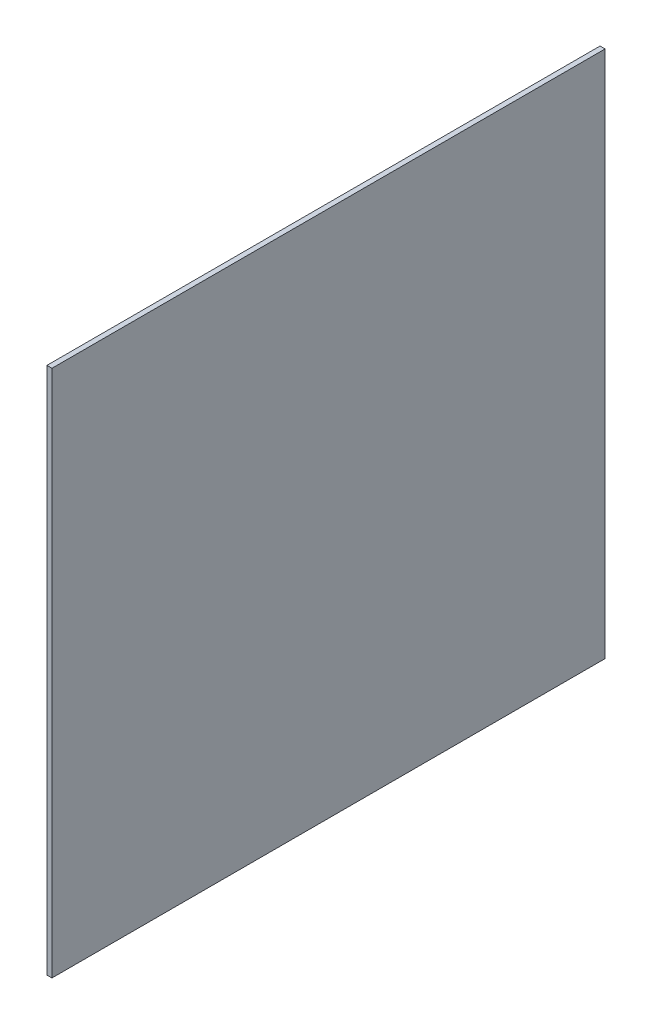
ISO-10303-21;
HEADER;
FILE_DESCRIPTION(('STEP AP214'),'2;1');
FILE_NAME('part.step','',(''),(''),'','','');
FILE_SCHEMA(('AUTOMOTIVE_DESIGN { 1 0 10303 214 1 1 1 1 }'));
ENDSEC;
DATA;
#1=APPLICATION_CONTEXT('core data for automotive mechanical design processes');
#2=APPLICATION_PROTOCOL_DEFINITION('international standard','automotive_design',2000,#1);
#3=PRODUCT_CONTEXT('',#1,'mechanical');
#4=PRODUCT('Part','Part','',(#3));
#5=PRODUCT_RELATED_PRODUCT_CATEGORY('part','',(#4));
#6=PRODUCT_DEFINITION_FORMATION('','',#4);
#7=PRODUCT_DEFINITION_CONTEXT('part definition',#1,'design');
#8=PRODUCT_DEFINITION('design','',#6,#7);
#9=PRODUCT_DEFINITION_SHAPE('','',#8);
#10=(LENGTH_UNIT() NAMED_UNIT(*) SI_UNIT(.MILLI.,.METRE.));
#11=(NAMED_UNIT(*) PLANE_ANGLE_UNIT() SI_UNIT($,.RADIAN.));
#12=(NAMED_UNIT(*) SI_UNIT($,.STERADIAN.) SOLID_ANGLE_UNIT());
#13=UNCERTAINTY_MEASURE_WITH_UNIT(LENGTH_MEASURE(1.E-05),#10,'distance_accuracy_value','');
#14=(GEOMETRIC_REPRESENTATION_CONTEXT(3) GLOBAL_UNCERTAINTY_ASSIGNED_CONTEXT((#13)) GLOBAL_UNIT_ASSIGNED_CONTEXT((#10,
#11,#12)) REPRESENTATION_CONTEXT('',''));
#15=CARTESIAN_POINT('',(0.,0.,0.));
#16=DIRECTION('',(0.,0.,1.));
#17=DIRECTION('',(1.,0.,0.));
#18=AXIS2_PLACEMENT_3D('',#15,#16,#17);
#19=CARTESIAN_POINT('',(-283.,239.840100222647,-224.));
#20=DIRECTION('',(0.,0.,-1.));
#21=DIRECTION('',(0.,1.,0.));
#22=AXIS2_PLACEMENT_3D('',#19,#20,#21);
#23=PLANE('',#22);
#24=DIRECTION('',(0.,-1.,0.));
#25=VECTOR('',#24,1.);
#26=CARTESIAN_POINT('',(-285.,239.840100222647,-224.));
#27=LINE('',#26,#25);
#28=CARTESIAN_POINT('',(-285.,239.840100222647,-224.));
#29=VERTEX_POINT('',#28);
#30=CARTESIAN_POINT('',(-285.,29.8401002226472,-224.));
#31=VERTEX_POINT('',#30);
#32=EDGE_CURVE('E112',#29,#31,#27,.T.);
#33=ORIENTED_EDGE('',*,*,#32,.F.);
#34=DIRECTION('',(-1.,0.,0.));
#35=VECTOR('',#34,1.);
#36=CARTESIAN_POINT('',(-283.,239.840100222647,-224.));
#37=LINE('',#36,#35);
#38=CARTESIAN_POINT('',(-283.,239.840100222647,-224.));
#39=VERTEX_POINT('',#38);
#40=EDGE_CURVE('E11',#39,#29,#37,.T.);
#41=ORIENTED_EDGE('',*,*,#40,.F.);
#42=DIRECTION('',(0.,-1.,0.));
#43=VECTOR('',#42,1.);
#44=CARTESIAN_POINT('',(-283.,239.840100222647,-224.));
#45=LINE('',#44,#43);
#46=CARTESIAN_POINT('',(-283.,29.8401002226472,-224.));
#47=VERTEX_POINT('',#46);
#48=EDGE_CURVE('E103',#39,#47,#45,.T.);
#49=ORIENTED_EDGE('',*,*,#48,.T.);
#50=DIRECTION('',(-1.,0.,0.));
#51=VECTOR('',#50,1.);
#52=CARTESIAN_POINT('',(-283.,29.8401002226472,-224.));
#53=LINE('',#52,#51);
#54=EDGE_CURVE('E44',#47,#31,#53,.T.);
#55=ORIENTED_EDGE('',*,*,#54,.T.);
#56=EDGE_LOOP('',(#33,#41,#49,#55));
#57=FACE_BOUND('',#56,.T.);
#58=ADVANCED_FACE('F41',(#57),#23,.T.);
#59=CARTESIAN_POINT('',(-283.,239.840100222647,-224.));
#60=DIRECTION('',(0.,1.,0.));
#61=DIRECTION('',(0.,0.,1.));
#62=AXIS2_PLACEMENT_3D('',#59,#60,#61);
#63=PLANE('',#62);
#64=DIRECTION('',(0.,0.,-1.));
#65=VECTOR('',#64,1.);
#66=CARTESIAN_POINT('',(-285.,239.840100222647,-224.));
#67=LINE('',#66,#65);
#68=CARTESIAN_POINT('',(-285.,239.840100222647,-4.00000000000003));
#69=VERTEX_POINT('',#68);
#70=EDGE_CURVE('E107',#69,#29,#67,.T.);
#71=ORIENTED_EDGE('',*,*,#70,.F.);
#72=DIRECTION('',(-1.,0.,0.));
#73=VECTOR('',#72,1.);
#74=CARTESIAN_POINT('',(-283.,239.840100222647,-4.00000000000003));
#75=LINE('',#74,#73);
#76=CARTESIAN_POINT('',(-283.,239.840100222647,-4.00000000000003));
#77=VERTEX_POINT('',#76);
#78=EDGE_CURVE('E51',#77,#69,#75,.T.);
#79=ORIENTED_EDGE('',*,*,#78,.F.);
#80=DIRECTION('',(0.,0.,-1.));
#81=VECTOR('',#80,1.);
#82=CARTESIAN_POINT('',(-283.,239.840100222647,-224.));
#83=LINE('',#82,#81);
#84=EDGE_CURVE('E98',#77,#39,#83,.T.);
#85=ORIENTED_EDGE('',*,*,#84,.T.);
#86=ORIENTED_EDGE('',*,*,#40,.T.);
#87=EDGE_LOOP('',(#71,#79,#85,#86));
#88=FACE_BOUND('',#87,.T.);
#89=ADVANCED_FACE('F131',(#88),#63,.T.);
#90=CARTESIAN_POINT('',(-283.,239.840100222647,-4.00000000000003));
#91=DIRECTION('',(0.,0.,1.));
#92=DIRECTION('',(0.,-1.,0.));
#93=AXIS2_PLACEMENT_3D('',#90,#91,#92);
#94=PLANE('',#93);
#95=DIRECTION('',(0.,1.,0.));
#96=VECTOR('',#95,1.);
#97=CARTESIAN_POINT('',(-285.,239.840100222647,-4.00000000000003));
#98=LINE('',#97,#96);
#99=CARTESIAN_POINT('',(-285.,29.8401002226472,-4.));
#100=VERTEX_POINT('',#99);
#101=EDGE_CURVE('E92',#100,#69,#98,.T.);
#102=ORIENTED_EDGE('',*,*,#101,.F.);
#103=DIRECTION('',(-1.,0.,0.));
#104=VECTOR('',#103,1.);
#105=CARTESIAN_POINT('',(-283.,29.8401002226472,-4.));
#106=LINE('',#105,#104);
#107=CARTESIAN_POINT('',(-283.,29.8401002226472,-4.));
#108=VERTEX_POINT('',#107);
#109=EDGE_CURVE('E87',#108,#100,#106,.T.);
#110=ORIENTED_EDGE('',*,*,#109,.F.);
#111=DIRECTION('',(0.,1.,0.));
#112=VECTOR('',#111,1.);
#113=CARTESIAN_POINT('',(-283.,239.840100222647,-4.00000000000003));
#114=LINE('',#113,#112);
#115=EDGE_CURVE('E90',#108,#77,#114,.T.);
#116=ORIENTED_EDGE('',*,*,#115,.T.);
#117=ORIENTED_EDGE('',*,*,#78,.T.);
#118=EDGE_LOOP('',(#102,#110,#116,#117));
#119=FACE_BOUND('',#118,.T.);
#120=ADVANCED_FACE('F89',(#119),#94,.T.);
#121=CARTESIAN_POINT('',(-283.,29.8401002226472,-224.));
#122=DIRECTION('',(0.,-1.,0.));
#123=DIRECTION('',(0.,0.,-1.));
#124=AXIS2_PLACEMENT_3D('',#121,#122,#123);
#125=PLANE('',#124);
#126=DIRECTION('',(0.,0.,1.));
#127=VECTOR('',#126,1.);
#128=CARTESIAN_POINT('',(-285.,29.8401002226472,-224.));
#129=LINE('',#128,#127);
#130=EDGE_CURVE('E116',#31,#100,#129,.T.);
#131=ORIENTED_EDGE('',*,*,#130,.F.);
#132=ORIENTED_EDGE('',*,*,#54,.F.);
#133=DIRECTION('',(0.,0.,1.));
#134=VECTOR('',#133,1.);
#135=CARTESIAN_POINT('',(-283.,29.8401002226472,-224.));
#136=LINE('',#135,#134);
#137=EDGE_CURVE('E97',#47,#108,#136,.T.);
#138=ORIENTED_EDGE('',*,*,#137,.T.);
#139=ORIENTED_EDGE('',*,*,#109,.T.);
#140=EDGE_LOOP('',(#131,#132,#138,#139));
#141=FACE_BOUND('',#140,.T.);
#142=ADVANCED_FACE('F101',(#141),#125,.T.);
#143=CARTESIAN_POINT('',(-283.,0.,0.));
#144=DIRECTION('',(-1.,0.,0.));
#145=DIRECTION('',(0.,0.,1.));
#146=AXIS2_PLACEMENT_3D('',#143,#144,#145);
#147=PLANE('',#146);
#148=ORIENTED_EDGE('',*,*,#48,.F.);
#149=ORIENTED_EDGE('',*,*,#84,.F.);
#150=ORIENTED_EDGE('',*,*,#115,.F.);
#151=ORIENTED_EDGE('',*,*,#137,.F.);
#152=EDGE_LOOP('',(#148,#149,#150,#151));
#153=FACE_BOUND('',#152,.T.);
#154=ADVANCED_FACE('F96',(#153),#147,.F.);
#155=CARTESIAN_POINT('',(-285.,0.,0.));
#156=DIRECTION('',(-1.,0.,0.));
#157=DIRECTION('',(0.,0.,1.));
#158=AXIS2_PLACEMENT_3D('',#155,#156,#157);
#159=PLANE('',#158);
#160=ORIENTED_EDGE('',*,*,#32,.T.);
#161=ORIENTED_EDGE('',*,*,#130,.T.);
#162=ORIENTED_EDGE('',*,*,#101,.T.);
#163=ORIENTED_EDGE('',*,*,#70,.T.);
#164=EDGE_LOOP('',(#160,#161,#162,#163));
#165=FACE_BOUND('',#164,.T.);
#166=ADVANCED_FACE('F130',(#165),#159,.T.);
#167=CLOSED_SHELL('',(#58,#89,#120,#142,#154,#166));
#168=MANIFOLD_SOLID_BREP('B2',#167);
#169=ADVANCED_BREP_SHAPE_REPRESENTATION('',(#18,#168),#14);
#170=SHAPE_DEFINITION_REPRESENTATION(#9,#169);
ENDSEC;
END-ISO-10303-21;
